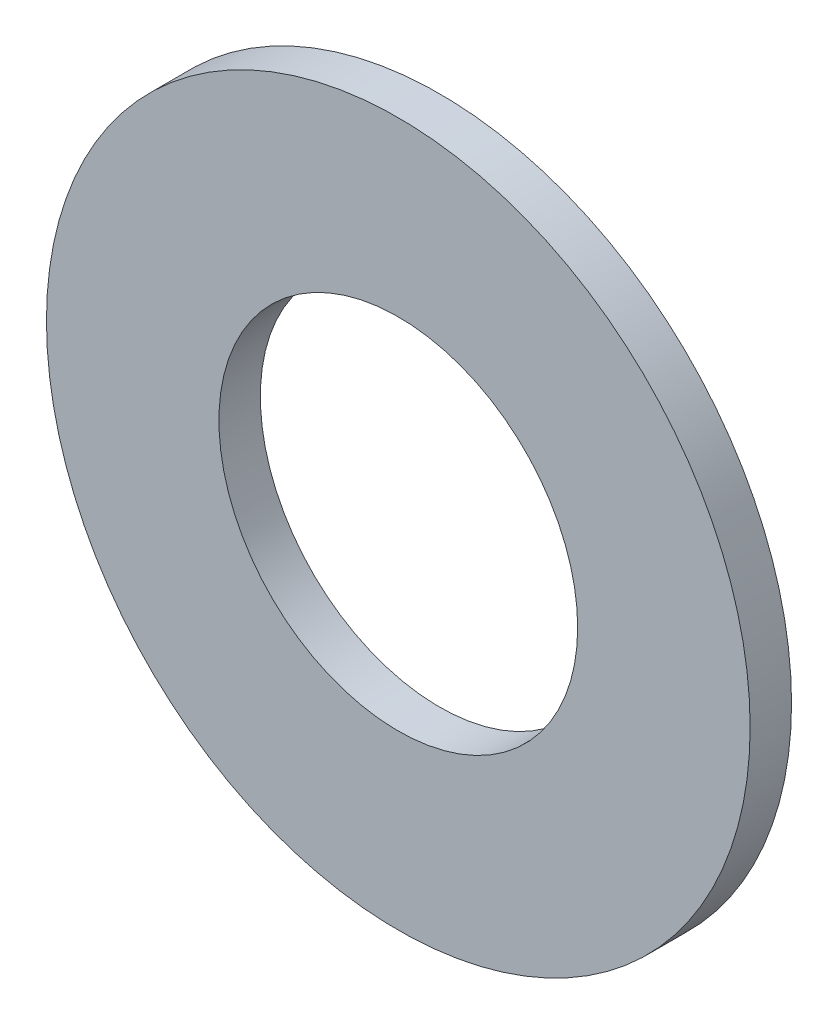
ISO-10303-21;
HEADER;
FILE_DESCRIPTION(('STEP AP214'),'2;1');
FILE_NAME('part.step','',(''),(''),'','','');
FILE_SCHEMA(('AUTOMOTIVE_DESIGN { 1 0 10303 214 1 1 1 1 }'));
ENDSEC;
DATA;
#1=APPLICATION_CONTEXT('core data for automotive mechanical design processes');
#2=APPLICATION_PROTOCOL_DEFINITION('international standard','automotive_design',2000,#1);
#3=PRODUCT_CONTEXT('',#1,'mechanical');
#4=PRODUCT('Part','Part','',(#3));
#5=PRODUCT_RELATED_PRODUCT_CATEGORY('part','',(#4));
#6=PRODUCT_DEFINITION_FORMATION('','',#4);
#7=PRODUCT_DEFINITION_CONTEXT('part definition',#1,'design');
#8=PRODUCT_DEFINITION('design','',#6,#7);
#9=PRODUCT_DEFINITION_SHAPE('','',#8);
#10=(LENGTH_UNIT() NAMED_UNIT(*) SI_UNIT(.MILLI.,.METRE.));
#11=(NAMED_UNIT(*) PLANE_ANGLE_UNIT() SI_UNIT($,.RADIAN.));
#12=(NAMED_UNIT(*) SI_UNIT($,.STERADIAN.) SOLID_ANGLE_UNIT());
#13=UNCERTAINTY_MEASURE_WITH_UNIT(LENGTH_MEASURE(1.E-05),#10,'distance_accuracy_value','');
#14=(GEOMETRIC_REPRESENTATION_CONTEXT(3) GLOBAL_UNCERTAINTY_ASSIGNED_CONTEXT((#13)) GLOBAL_UNIT_ASSIGNED_CONTEXT((#10,
#11,#12)) REPRESENTATION_CONTEXT('',''));
#15=CARTESIAN_POINT('',(0.,0.,0.));
#16=DIRECTION('',(0.,0.,1.));
#17=DIRECTION('',(1.,0.,0.));
#18=AXIS2_PLACEMENT_3D('',#15,#16,#17);
#19=CARTESIAN_POINT('',(0.,0.,0.6));
#20=DIRECTION('',(0.,0.,-1.));
#21=DIRECTION('',(-1.,0.,0.));
#22=AXIS2_PLACEMENT_3D('',#19,#20,#21);
#23=PLANE('',#22);
#24=CARTESIAN_POINT('',(0.,0.,0.6));
#25=DIRECTION('',(0.,0.,1.));
#26=DIRECTION('',(1.,0.,0.));
#27=AXIS2_PLACEMENT_3D('',#24,#25,#26);
#28=CIRCLE('',#27,2.6);
#29=CARTESIAN_POINT('',(2.6,0.,0.6));
#30=VERTEX_POINT('',#29);
#31=EDGE_CURVE('E27',#30,#30,#28,.F.);
#32=ORIENTED_EDGE('',*,*,#31,.T.);
#33=EDGE_LOOP('',(#32));
#34=FACE_BOUND('',#33,.T.);
#35=CARTESIAN_POINT('',(0.,0.,0.6));
#36=DIRECTION('',(0.,0.,1.));
#37=DIRECTION('',(1.,0.,0.));
#38=AXIS2_PLACEMENT_3D('',#35,#36,#37);
#39=CIRCLE('',#38,5.1);
#40=CARTESIAN_POINT('',(5.1,0.,0.6));
#41=VERTEX_POINT('',#40);
#42=EDGE_CURVE('E18',#41,#41,#39,.F.);
#43=ORIENTED_EDGE('',*,*,#42,.F.);
#44=EDGE_LOOP('',(#43));
#45=FACE_BOUND('',#44,.T.);
#46=ADVANCED_FACE('F15',(#34,#45),#23,.F.);
#47=CARTESIAN_POINT('',(0.,0.,0.));
#48=DIRECTION('',(0.,0.,1.));
#49=DIRECTION('',(1.,0.,0.));
#50=AXIS2_PLACEMENT_3D('',#47,#48,#49);
#51=CYLINDRICAL_SURFACE('',#50,5.1);
#52=CARTESIAN_POINT('',(0.,0.,0.));
#53=DIRECTION('',(0.,0.,1.));
#54=DIRECTION('',(1.,0.,0.));
#55=AXIS2_PLACEMENT_3D('',#52,#53,#54);
#56=CIRCLE('',#55,5.1);
#57=CARTESIAN_POINT('',(5.1,0.,0.));
#58=VERTEX_POINT('',#57);
#59=EDGE_CURVE('E22',#58,#58,#56,.F.);
#60=ORIENTED_EDGE('',*,*,#59,.F.);
#61=EDGE_LOOP('',(#60));
#62=FACE_BOUND('',#61,.T.);
#63=ORIENTED_EDGE('',*,*,#42,.T.);
#64=EDGE_LOOP('',(#63));
#65=FACE_BOUND('',#64,.T.);
#66=ADVANCED_FACE('F35',(#62,#65),#51,.T.);
#67=CARTESIAN_POINT('',(0.,0.,0.));
#68=DIRECTION('',(0.,0.,1.));
#69=DIRECTION('',(1.,0.,0.));
#70=AXIS2_PLACEMENT_3D('',#67,#68,#69);
#71=CYLINDRICAL_SURFACE('',#70,2.6);
#72=ORIENTED_EDGE('',*,*,#31,.F.);
#73=EDGE_LOOP('',(#72));
#74=FACE_BOUND('',#73,.T.);
#75=CARTESIAN_POINT('',(0.,0.,0.));
#76=DIRECTION('',(0.,0.,1.));
#77=DIRECTION('',(1.,0.,0.));
#78=AXIS2_PLACEMENT_3D('',#75,#76,#77);
#79=CIRCLE('',#78,2.6);
#80=CARTESIAN_POINT('',(2.6,0.,0.));
#81=VERTEX_POINT('',#80);
#82=EDGE_CURVE('E10',#81,#81,#79,.T.);
#83=ORIENTED_EDGE('',*,*,#82,.F.);
#84=EDGE_LOOP('',(#83));
#85=FACE_BOUND('',#84,.T.);
#86=ADVANCED_FACE('F42',(#74,#85),#71,.F.);
#87=CARTESIAN_POINT('',(0.,0.,0.));
#88=DIRECTION('',(0.,0.,-1.));
#89=DIRECTION('',(-1.,0.,0.));
#90=AXIS2_PLACEMENT_3D('',#87,#88,#89);
#91=PLANE('',#90);
#92=ORIENTED_EDGE('',*,*,#82,.T.);
#93=EDGE_LOOP('',(#92));
#94=FACE_BOUND('',#93,.T.);
#95=ORIENTED_EDGE('',*,*,#59,.T.);
#96=EDGE_LOOP('',(#95));
#97=FACE_BOUND('',#96,.T.);
#98=ADVANCED_FACE('F44',(#94,#97),#91,.T.);
#99=CLOSED_SHELL('',(#46,#66,#86,#98));
#100=MANIFOLD_SOLID_BREP('B1',#99);
#101=ADVANCED_BREP_SHAPE_REPRESENTATION('',(#18,#100),#14);
#102=SHAPE_DEFINITION_REPRESENTATION(#9,#101);
ENDSEC;
END-ISO-10303-21;
